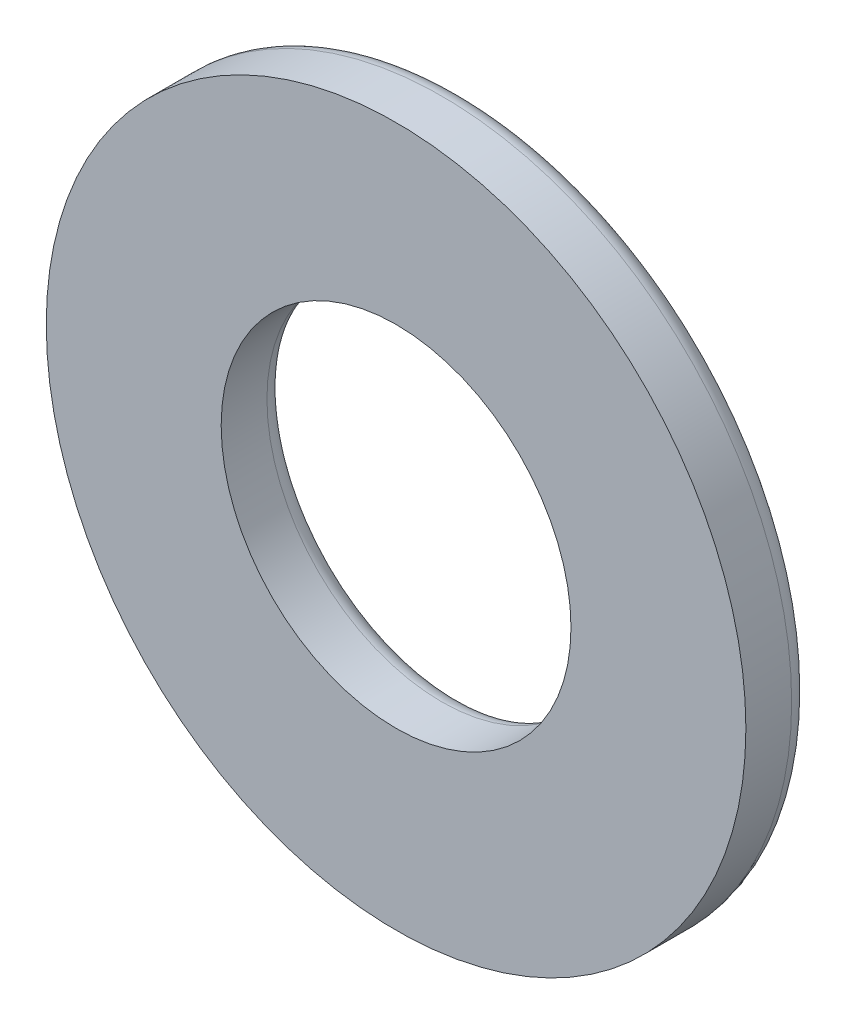
ISO-10303-21;
HEADER;
FILE_DESCRIPTION(('STEP AP214'),'2;1');
FILE_NAME('part.step','',(''),(''),'','','');
FILE_SCHEMA(('AUTOMOTIVE_DESIGN { 1 0 10303 214 1 1 1 1 }'));
ENDSEC;
DATA;
#1=APPLICATION_CONTEXT('core data for automotive mechanical design processes');
#2=APPLICATION_PROTOCOL_DEFINITION('international standard','automotive_design',2000,#1);
#3=PRODUCT_CONTEXT('',#1,'mechanical');
#4=PRODUCT('Part','Part','',(#3));
#5=PRODUCT_RELATED_PRODUCT_CATEGORY('part','',(#4));
#6=PRODUCT_DEFINITION_FORMATION('','',#4);
#7=PRODUCT_DEFINITION_CONTEXT('part definition',#1,'design');
#8=PRODUCT_DEFINITION('design','',#6,#7);
#9=PRODUCT_DEFINITION_SHAPE('','',#8);
#10=(LENGTH_UNIT() NAMED_UNIT(*) SI_UNIT(.MILLI.,.METRE.));
#11=(NAMED_UNIT(*) PLANE_ANGLE_UNIT() SI_UNIT($,.RADIAN.));
#12=(NAMED_UNIT(*) SI_UNIT($,.STERADIAN.) SOLID_ANGLE_UNIT());
#13=UNCERTAINTY_MEASURE_WITH_UNIT(LENGTH_MEASURE(1.E-05),#10,'distance_accuracy_value','');
#14=(GEOMETRIC_REPRESENTATION_CONTEXT(3) GLOBAL_UNCERTAINTY_ASSIGNED_CONTEXT((#13)) GLOBAL_UNIT_ASSIGNED_CONTEXT((#10,
#11,#12)) REPRESENTATION_CONTEXT('',''));
#15=CARTESIAN_POINT('',(0.,0.,0.));
#16=DIRECTION('',(0.,0.,1.));
#17=DIRECTION('',(1.,0.,0.));
#18=AXIS2_PLACEMENT_3D('',#15,#16,#17);
#19=CARTESIAN_POINT('',(0.,0.,2.54));
#20=DIRECTION('',(0.,0.,1.));
#21=DIRECTION('',(1.,0.,0.));
#22=AXIS2_PLACEMENT_3D('',#19,#20,#21);
#23=PLANE('',#22);
#24=CARTESIAN_POINT('',(0.,0.,2.54));
#25=DIRECTION('',(0.,0.,1.));
#26=DIRECTION('',(1.,0.,0.));
#27=AXIS2_PLACEMENT_3D('',#24,#25,#26);
#28=CIRCLE('',#27,13.589);
#29=CARTESIAN_POINT('',(13.589,0.,2.54));
#30=VERTEX_POINT('',#29);
#31=EDGE_CURVE('E59',#30,#30,#28,.T.);
#32=ORIENTED_EDGE('',*,*,#31,.T.);
#33=EDGE_LOOP('',(#32));
#34=FACE_BOUND('',#33,.T.);
#35=CARTESIAN_POINT('',(0.,0.,2.54));
#36=DIRECTION('',(0.,0.,1.));
#37=DIRECTION('',(1.,0.,0.));
#38=AXIS2_PLACEMENT_3D('',#35,#36,#37);
#39=CIRCLE('',#38,6.7945);
#40=CARTESIAN_POINT('',(6.7945,0.,2.54));
#41=VERTEX_POINT('',#40);
#42=EDGE_CURVE('E62',#41,#41,#39,.T.);
#43=ORIENTED_EDGE('',*,*,#42,.F.);
#44=EDGE_LOOP('',(#43));
#45=FACE_BOUND('',#44,.T.);
#46=ADVANCED_FACE('F39',(#34,#45),#23,.T.);
#47=CARTESIAN_POINT('',(0.,0.,0.));
#48=DIRECTION('',(0.,0.,1.));
#49=DIRECTION('',(1.,0.,0.));
#50=AXIS2_PLACEMENT_3D('',#47,#48,#49);
#51=PLANE('',#50);
#52=CARTESIAN_POINT('',(0.,0.,0.));
#53=DIRECTION('',(0.,0.,1.));
#54=DIRECTION('',(1.,0.,0.));
#55=AXIS2_PLACEMENT_3D('',#52,#53,#54);
#56=CIRCLE('',#55,7.5565);
#57=CARTESIAN_POINT('',(7.5565,0.,0.));
#58=VERTEX_POINT('',#57);
#59=EDGE_CURVE('E50',#58,#58,#56,.T.);
#60=ORIENTED_EDGE('',*,*,#59,.T.);
#61=EDGE_LOOP('',(#60));
#62=FACE_BOUND('',#61,.T.);
#63=CARTESIAN_POINT('',(0.,0.,0.));
#64=DIRECTION('',(0.,0.,1.));
#65=DIRECTION('',(1.,0.,0.));
#66=AXIS2_PLACEMENT_3D('',#63,#64,#65);
#67=CIRCLE('',#66,12.827);
#68=CARTESIAN_POINT('',(12.827,0.,0.));
#69=VERTEX_POINT('',#68);
#70=EDGE_CURVE('E54',#69,#69,#67,.F.);
#71=ORIENTED_EDGE('',*,*,#70,.T.);
#72=EDGE_LOOP('',(#71));
#73=FACE_BOUND('',#72,.T.);
#74=ADVANCED_FACE('F69',(#62,#73),#51,.F.);
#75=CARTESIAN_POINT('',(0.,0.,2.54));
#76=DIRECTION('',(0.,0.,-1.));
#77=DIRECTION('',(-1.,0.,0.));
#78=AXIS2_PLACEMENT_3D('',#75,#76,#77);
#79=CYLINDRICAL_SURFACE('',#78,13.589);
#80=CARTESIAN_POINT('',(0.,0.,0.762));
#81=DIRECTION('',(0.,0.,1.));
#82=DIRECTION('',(1.,0.,0.));
#83=AXIS2_PLACEMENT_3D('',#80,#81,#82);
#84=CIRCLE('',#83,13.589);
#85=CARTESIAN_POINT('',(13.589,0.,0.762));
#86=VERTEX_POINT('',#85);
#87=EDGE_CURVE('E10',#86,#86,#84,.T.);
#88=ORIENTED_EDGE('',*,*,#87,.T.);
#89=EDGE_LOOP('',(#88));
#90=FACE_BOUND('',#89,.T.);
#91=ORIENTED_EDGE('',*,*,#31,.F.);
#92=EDGE_LOOP('',(#91));
#93=FACE_BOUND('',#92,.T.);
#94=ADVANCED_FACE('F75',(#90,#93),#79,.T.);
#95=CARTESIAN_POINT('',(0.,0.,2.54));
#96=DIRECTION('',(0.,0.,-1.));
#97=DIRECTION('',(-1.,0.,0.));
#98=AXIS2_PLACEMENT_3D('',#95,#96,#97);
#99=CYLINDRICAL_SURFACE('',#98,6.7945);
#100=CARTESIAN_POINT('',(0.,0.,0.762));
#101=DIRECTION('',(0.,0.,1.));
#102=DIRECTION('',(1.,0.,0.));
#103=AXIS2_PLACEMENT_3D('',#100,#101,#102);
#104=CIRCLE('',#103,6.7945);
#105=CARTESIAN_POINT('',(6.7945,0.,0.762));
#106=VERTEX_POINT('',#105);
#107=EDGE_CURVE('E46',#106,#106,#104,.F.);
#108=ORIENTED_EDGE('',*,*,#107,.T.);
#109=EDGE_LOOP('',(#108));
#110=FACE_BOUND('',#109,.T.);
#111=ORIENTED_EDGE('',*,*,#42,.T.);
#112=EDGE_LOOP('',(#111));
#113=FACE_BOUND('',#112,.T.);
#114=ADVANCED_FACE('F66',(#110,#113),#99,.F.);
#115=CARTESIAN_POINT('',(0.,0.,0.762));
#116=DIRECTION('',(0.,0.,1.));
#117=DIRECTION('',(1.,0.,0.));
#118=AXIS2_PLACEMENT_3D('',#115,#116,#117);
#119=TOROIDAL_SURFACE('',#118,7.5565,0.762);
#120=ORIENTED_EDGE('',*,*,#107,.F.);
#121=EDGE_LOOP('',(#120));
#122=FACE_BOUND('',#121,.T.);
#123=ORIENTED_EDGE('',*,*,#59,.F.);
#124=EDGE_LOOP('',(#123));
#125=FACE_BOUND('',#124,.T.);
#126=ADVANCED_FACE('F81',(#122,#125),#119,.T.);
#127=CARTESIAN_POINT('',(0.,0.,0.762));
#128=DIRECTION('',(0.,0.,1.));
#129=DIRECTION('',(1.,0.,0.));
#130=AXIS2_PLACEMENT_3D('',#127,#128,#129);
#131=TOROIDAL_SURFACE('',#130,12.827,0.762);
#132=ORIENTED_EDGE('',*,*,#70,.F.);
#133=EDGE_LOOP('',(#132));
#134=FACE_BOUND('',#133,.T.);
#135=ORIENTED_EDGE('',*,*,#87,.F.);
#136=EDGE_LOOP('',(#135));
#137=FACE_BOUND('',#136,.T.);
#138=ADVANCED_FACE('F41',(#134,#137),#131,.T.);
#139=CLOSED_SHELL('',(#46,#74,#94,#114,#126,#138));
#140=MANIFOLD_SOLID_BREP('B2',#139);
#141=ADVANCED_BREP_SHAPE_REPRESENTATION('',(#18,#140),#14);
#142=SHAPE_DEFINITION_REPRESENTATION(#9,#141);
ENDSEC;
END-ISO-10303-21;
